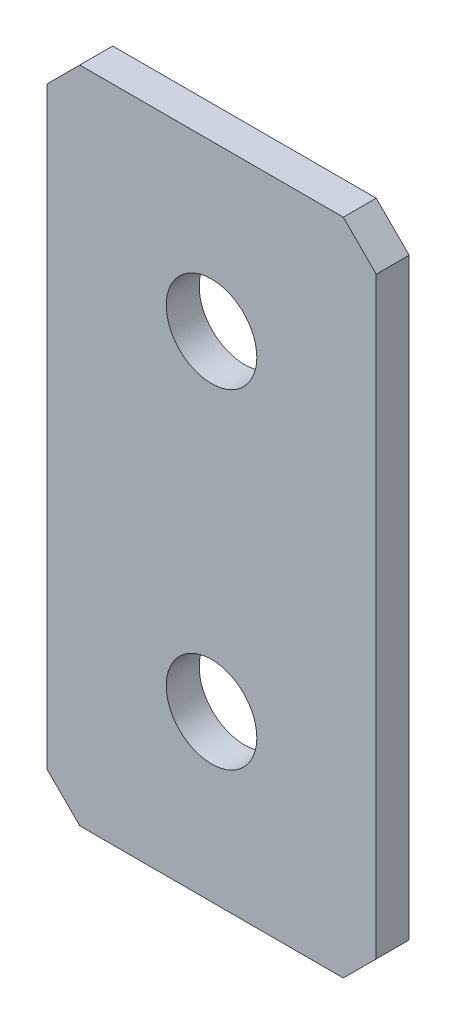
ISO-10303-21;
HEADER;
FILE_DESCRIPTION(('STEP AP214'),'2;1');
FILE_NAME('part.step','',(''),(''),'','','');
FILE_SCHEMA(('AUTOMOTIVE_DESIGN { 1 0 10303 214 1 1 1 1 }'));
ENDSEC;
DATA;
#1=APPLICATION_CONTEXT('core data for automotive mechanical design processes');
#2=APPLICATION_PROTOCOL_DEFINITION('international standard','automotive_design',2000,#1);
#3=PRODUCT_CONTEXT('',#1,'mechanical');
#4=PRODUCT('Part','Part','',(#3));
#5=PRODUCT_RELATED_PRODUCT_CATEGORY('part','',(#4));
#6=PRODUCT_DEFINITION_FORMATION('','',#4);
#7=PRODUCT_DEFINITION_CONTEXT('part definition',#1,'design');
#8=PRODUCT_DEFINITION('design','',#6,#7);
#9=PRODUCT_DEFINITION_SHAPE('','',#8);
#10=(LENGTH_UNIT() NAMED_UNIT(*) SI_UNIT(.MILLI.,.METRE.));
#11=(NAMED_UNIT(*) PLANE_ANGLE_UNIT() SI_UNIT($,.RADIAN.));
#12=(NAMED_UNIT(*) SI_UNIT($,.STERADIAN.) SOLID_ANGLE_UNIT());
#13=UNCERTAINTY_MEASURE_WITH_UNIT(LENGTH_MEASURE(1.E-05),#10,'distance_accuracy_value','');
#14=(GEOMETRIC_REPRESENTATION_CONTEXT(3) GLOBAL_UNCERTAINTY_ASSIGNED_CONTEXT((#13)) GLOBAL_UNIT_ASSIGNED_CONTEXT((#10,
#11,#12)) REPRESENTATION_CONTEXT('',''));
#15=CARTESIAN_POINT('',(0.,0.,0.));
#16=DIRECTION('',(0.,0.,1.));
#17=DIRECTION('',(1.,0.,0.));
#18=AXIS2_PLACEMENT_3D('',#15,#16,#17);
#19=CARTESIAN_POINT('',(9.99999999999999,-20.,2.));
#20=DIRECTION('',(-1.,0.,0.));
#21=DIRECTION('',(0.,0.,1.));
#22=AXIS2_PLACEMENT_3D('',#19,#20,#21);
#23=PLANE('',#22);
#24=DIRECTION('',(0.,1.,0.));
#25=VECTOR('',#24,1.);
#26=CARTESIAN_POINT('',(9.99999999999999,-20.,2.));
#27=LINE('',#26,#25);
#28=CARTESIAN_POINT('',(9.99999999999999,-18.,2.));
#29=VERTEX_POINT('',#28);
#30=CARTESIAN_POINT('',(9.99999999999999,18.,2.));
#31=VERTEX_POINT('',#30);
#32=EDGE_CURVE('E127',#29,#31,#27,.T.);
#33=ORIENTED_EDGE('',*,*,#32,.F.);
#34=DIRECTION('',(0.,0.,-1.));
#35=VECTOR('',#34,1.);
#36=CARTESIAN_POINT('',(9.99999999999999,-18.,2.));
#37=LINE('',#36,#35);
#38=CARTESIAN_POINT('',(9.99999999999999,-18.,0.));
#39=VERTEX_POINT('',#38);
#40=EDGE_CURVE('E153',#29,#39,#37,.T.);
#41=ORIENTED_EDGE('',*,*,#40,.T.);
#42=DIRECTION('',(0.,1.,0.));
#43=VECTOR('',#42,1.);
#44=CARTESIAN_POINT('',(9.99999999999999,-20.,0.));
#45=LINE('',#44,#43);
#46=CARTESIAN_POINT('',(9.99999999999999,18.,0.));
#47=VERTEX_POINT('',#46);
#48=EDGE_CURVE('E161',#39,#47,#45,.T.);
#49=ORIENTED_EDGE('',*,*,#48,.T.);
#50=DIRECTION('',(0.,0.,1.));
#51=VECTOR('',#50,1.);
#52=CARTESIAN_POINT('',(9.99999999999999,18.,2.));
#53=LINE('',#52,#51);
#54=EDGE_CURVE('E151',#47,#31,#53,.T.);
#55=ORIENTED_EDGE('',*,*,#54,.T.);
#56=EDGE_LOOP('',(#33,#41,#49,#55));
#57=FACE_BOUND('',#56,.T.);
#58=ADVANCED_FACE('F36',(#57),#23,.F.);
#59=CARTESIAN_POINT('',(-10.,20.,2.));
#60=DIRECTION('',(0.,-1.,0.));
#61=DIRECTION('',(0.,0.,-1.));
#62=AXIS2_PLACEMENT_3D('',#59,#60,#61);
#63=PLANE('',#62);
#64=DIRECTION('',(-1.,0.,0.));
#65=VECTOR('',#64,1.);
#66=CARTESIAN_POINT('',(-10.,20.,0.));
#67=LINE('',#66,#65);
#68=CARTESIAN_POINT('',(8.,20.,0.));
#69=VERTEX_POINT('',#68);
#70=CARTESIAN_POINT('',(-8.00000000000001,20.,0.));
#71=VERTEX_POINT('',#70);
#72=EDGE_CURVE('E132',#69,#71,#67,.T.);
#73=ORIENTED_EDGE('',*,*,#72,.T.);
#74=DIRECTION('',(0.,0.,1.));
#75=VECTOR('',#74,1.);
#76=CARTESIAN_POINT('',(-8.00000000000001,20.,2.));
#77=LINE('',#76,#75);
#78=CARTESIAN_POINT('',(-8.00000000000001,20.,2.));
#79=VERTEX_POINT('',#78);
#80=EDGE_CURVE('E11',#71,#79,#77,.T.);
#81=ORIENTED_EDGE('',*,*,#80,.T.);
#82=DIRECTION('',(-1.,0.,0.));
#83=VECTOR('',#82,1.);
#84=CARTESIAN_POINT('',(-10.,20.,2.));
#85=LINE('',#84,#83);
#86=CARTESIAN_POINT('',(8.,20.,2.));
#87=VERTEX_POINT('',#86);
#88=EDGE_CURVE('E130',#87,#79,#85,.T.);
#89=ORIENTED_EDGE('',*,*,#88,.F.);
#90=DIRECTION('',(0.,0.,-1.));
#91=VECTOR('',#90,1.);
#92=CARTESIAN_POINT('',(8.,20.,2.));
#93=LINE('',#92,#91);
#94=EDGE_CURVE('E44',#87,#69,#93,.T.);
#95=ORIENTED_EDGE('',*,*,#94,.T.);
#96=EDGE_LOOP('',(#73,#81,#89,#95));
#97=FACE_BOUND('',#96,.T.);
#98=ADVANCED_FACE('F158',(#97),#63,.F.);
#99=CARTESIAN_POINT('',(-10.,-20.,2.));
#100=DIRECTION('',(1.,0.,0.));
#101=DIRECTION('',(0.,0.,-1.));
#102=AXIS2_PLACEMENT_3D('',#99,#100,#101);
#103=PLANE('',#102);
#104=DIRECTION('',(0.,-1.,0.));
#105=VECTOR('',#104,1.);
#106=CARTESIAN_POINT('',(-10.,-20.,0.));
#107=LINE('',#106,#105);
#108=CARTESIAN_POINT('',(-10.,18.,0.));
#109=VERTEX_POINT('',#108);
#110=CARTESIAN_POINT('',(-10.,-18.,0.));
#111=VERTEX_POINT('',#110);
#112=EDGE_CURVE('E128',#109,#111,#107,.T.);
#113=ORIENTED_EDGE('',*,*,#112,.T.);
#114=DIRECTION('',(0.,0.,1.));
#115=VECTOR('',#114,1.);
#116=CARTESIAN_POINT('',(-10.,-18.,2.));
#117=LINE('',#116,#115);
#118=CARTESIAN_POINT('',(-10.,-18.,2.));
#119=VERTEX_POINT('',#118);
#120=EDGE_CURVE('E106',#111,#119,#117,.T.);
#121=ORIENTED_EDGE('',*,*,#120,.T.);
#122=DIRECTION('',(0.,-1.,0.));
#123=VECTOR('',#122,1.);
#124=CARTESIAN_POINT('',(-10.,-20.,2.));
#125=LINE('',#124,#123);
#126=CARTESIAN_POINT('',(-10.,18.,2.));
#127=VERTEX_POINT('',#126);
#128=EDGE_CURVE('E166',#127,#119,#125,.T.);
#129=ORIENTED_EDGE('',*,*,#128,.F.);
#130=DIRECTION('',(0.,0.,-1.));
#131=VECTOR('',#130,1.);
#132=CARTESIAN_POINT('',(-10.,18.,2.));
#133=LINE('',#132,#131);
#134=EDGE_CURVE('E111',#127,#109,#133,.T.);
#135=ORIENTED_EDGE('',*,*,#134,.T.);
#136=EDGE_LOOP('',(#113,#121,#129,#135));
#137=FACE_BOUND('',#136,.T.);
#138=ADVANCED_FACE('F193',(#137),#103,.F.);
#139=CARTESIAN_POINT('',(-10.,-20.,2.));
#140=DIRECTION('',(0.,1.,0.));
#141=DIRECTION('',(0.,0.,1.));
#142=AXIS2_PLACEMENT_3D('',#139,#140,#141);
#143=PLANE('',#142);
#144=DIRECTION('',(1.,0.,0.));
#145=VECTOR('',#144,1.);
#146=CARTESIAN_POINT('',(-10.,-20.,2.));
#147=LINE('',#146,#145);
#148=CARTESIAN_POINT('',(-8.00000000000001,-20.,2.));
#149=VERTEX_POINT('',#148);
#150=CARTESIAN_POINT('',(8.,-20.,2.));
#151=VERTEX_POINT('',#150);
#152=EDGE_CURVE('E121',#149,#151,#147,.T.);
#153=ORIENTED_EDGE('',*,*,#152,.F.);
#154=DIRECTION('',(0.,0.,-1.));
#155=VECTOR('',#154,1.);
#156=CARTESIAN_POINT('',(-8.00000000000001,-20.,2.));
#157=LINE('',#156,#155);
#158=CARTESIAN_POINT('',(-8.00000000000001,-20.,0.));
#159=VERTEX_POINT('',#158);
#160=EDGE_CURVE('E105',#149,#159,#157,.T.);
#161=ORIENTED_EDGE('',*,*,#160,.T.);
#162=DIRECTION('',(1.,0.,0.));
#163=VECTOR('',#162,1.);
#164=CARTESIAN_POINT('',(-10.,-20.,0.));
#165=LINE('',#164,#163);
#166=CARTESIAN_POINT('',(8.,-20.,0.));
#167=VERTEX_POINT('',#166);
#168=EDGE_CURVE('E118',#159,#167,#165,.T.);
#169=ORIENTED_EDGE('',*,*,#168,.T.);
#170=DIRECTION('',(0.,0.,1.));
#171=VECTOR('',#170,1.);
#172=CARTESIAN_POINT('',(8.,-20.,2.));
#173=LINE('',#172,#171);
#174=EDGE_CURVE('E123',#167,#151,#173,.T.);
#175=ORIENTED_EDGE('',*,*,#174,.T.);
#176=EDGE_LOOP('',(#153,#161,#169,#175));
#177=FACE_BOUND('',#176,.T.);
#178=ADVANCED_FACE('F117',(#177),#143,.F.);
#179=CARTESIAN_POINT('',(0.,0.,2.));
#180=DIRECTION('',(0.,0.,-1.));
#181=DIRECTION('',(-1.,0.,0.));
#182=AXIS2_PLACEMENT_3D('',#179,#180,#181);
#183=PLANE('',#182);
#184=CARTESIAN_POINT('',(0.,10.,2.));
#185=DIRECTION('',(0.,0.,1.));
#186=DIRECTION('',(1.,0.,0.));
#187=AXIS2_PLACEMENT_3D('',#184,#185,#186);
#188=CIRCLE('',#187,2.75);
#189=CARTESIAN_POINT('',(2.75,10.,2.));
#190=VERTEX_POINT('',#189);
#191=EDGE_CURVE('E178',#190,#190,#188,.T.);
#192=ORIENTED_EDGE('',*,*,#191,.F.);
#193=EDGE_LOOP('',(#192));
#194=FACE_BOUND('',#193,.T.);
#195=CARTESIAN_POINT('',(0.,-10.,2.));
#196=DIRECTION('',(0.,0.,1.));
#197=DIRECTION('',(1.,0.,0.));
#198=AXIS2_PLACEMENT_3D('',#195,#196,#197);
#199=CIRCLE('',#198,2.75);
#200=CARTESIAN_POINT('',(2.75000000000001,-10.,2.));
#201=VERTEX_POINT('',#200);
#202=EDGE_CURVE('E172',#201,#201,#199,.T.);
#203=ORIENTED_EDGE('',*,*,#202,.F.);
#204=EDGE_LOOP('',(#203));
#205=FACE_BOUND('',#204,.T.);
#206=ORIENTED_EDGE('',*,*,#128,.T.);
#207=DIRECTION('',(-0.707106781186546,0.707106781186549,0.));
#208=VECTOR('',#207,1.);
#209=CARTESIAN_POINT('',(-8.00000000000001,-20.,2.));
#210=LINE('',#209,#208);
#211=EDGE_CURVE('E149',#119,#149,#210,.F.);
#212=ORIENTED_EDGE('',*,*,#211,.T.);
#213=ORIENTED_EDGE('',*,*,#152,.T.);
#214=DIRECTION('',(-0.70710678118655,-0.707106781186545,0.));
#215=VECTOR('',#214,1.);
#216=CARTESIAN_POINT('',(9.99999999999999,-18.,2.));
#217=LINE('',#216,#215);
#218=EDGE_CURVE('E147',#151,#29,#217,.F.);
#219=ORIENTED_EDGE('',*,*,#218,.T.);
#220=ORIENTED_EDGE('',*,*,#32,.T.);
#221=DIRECTION('',(0.707106781186546,-0.707106781186549,0.));
#222=VECTOR('',#221,1.);
#223=CARTESIAN_POINT('',(8.,20.,2.));
#224=LINE('',#223,#222);
#225=EDGE_CURVE('E56',#31,#87,#224,.F.);
#226=ORIENTED_EDGE('',*,*,#225,.T.);
#227=ORIENTED_EDGE('',*,*,#88,.T.);
#228=DIRECTION('',(0.70710678118655,0.707106781186545,0.));
#229=VECTOR('',#228,1.);
#230=CARTESIAN_POINT('',(-10.,18.,2.));
#231=LINE('',#230,#229);
#232=EDGE_CURVE('E145',#79,#127,#231,.F.);
#233=ORIENTED_EDGE('',*,*,#232,.T.);
#234=EDGE_LOOP('',(#206,#212,#213,#219,#220,#226,#227,#233));
#235=FACE_BOUND('',#234,.T.);
#236=ADVANCED_FACE('F184',(#194,#205,#235),#183,.F.);
#237=CARTESIAN_POINT('',(0.,0.,0.));
#238=DIRECTION('',(0.,0.,-1.));
#239=DIRECTION('',(-1.,0.,0.));
#240=AXIS2_PLACEMENT_3D('',#237,#238,#239);
#241=PLANE('',#240);
#242=CARTESIAN_POINT('',(0.,10.,0.));
#243=DIRECTION('',(0.,0.,1.));
#244=DIRECTION('',(1.,0.,0.));
#245=AXIS2_PLACEMENT_3D('',#242,#243,#244);
#246=CIRCLE('',#245,2.75);
#247=CARTESIAN_POINT('',(2.75,10.,0.));
#248=VERTEX_POINT('',#247);
#249=EDGE_CURVE('E175',#248,#248,#246,.T.);
#250=ORIENTED_EDGE('',*,*,#249,.T.);
#251=EDGE_LOOP('',(#250));
#252=FACE_BOUND('',#251,.T.);
#253=CARTESIAN_POINT('',(0.,-10.,0.));
#254=DIRECTION('',(0.,0.,1.));
#255=DIRECTION('',(1.,0.,0.));
#256=AXIS2_PLACEMENT_3D('',#253,#254,#255);
#257=CIRCLE('',#256,2.75);
#258=CARTESIAN_POINT('',(2.75000000000001,-10.,0.));
#259=VERTEX_POINT('',#258);
#260=EDGE_CURVE('E162',#259,#259,#257,.T.);
#261=ORIENTED_EDGE('',*,*,#260,.T.);
#262=EDGE_LOOP('',(#261));
#263=FACE_BOUND('',#262,.T.);
#264=ORIENTED_EDGE('',*,*,#168,.F.);
#265=DIRECTION('',(0.707106781186546,-0.707106781186549,0.));
#266=VECTOR('',#265,1.);
#267=CARTESIAN_POINT('',(-14.,-14.,0.));
#268=LINE('',#267,#266);
#269=EDGE_CURVE('E101',#159,#111,#268,.F.);
#270=ORIENTED_EDGE('',*,*,#269,.T.);
#271=ORIENTED_EDGE('',*,*,#112,.F.);
#272=DIRECTION('',(-0.70710678118655,-0.707106781186545,0.));
#273=VECTOR('',#272,1.);
#274=CARTESIAN_POINT('',(-14.,14.0000000000001,0.));
#275=LINE('',#274,#273);
#276=EDGE_CURVE('E138',#109,#71,#275,.F.);
#277=ORIENTED_EDGE('',*,*,#276,.T.);
#278=ORIENTED_EDGE('',*,*,#72,.F.);
#279=DIRECTION('',(-0.707106781186546,0.707106781186549,0.));
#280=VECTOR('',#279,1.);
#281=CARTESIAN_POINT('',(14.,14.,0.));
#282=LINE('',#281,#280);
#283=EDGE_CURVE('E122',#69,#47,#282,.F.);
#284=ORIENTED_EDGE('',*,*,#283,.T.);
#285=ORIENTED_EDGE('',*,*,#48,.F.);
#286=DIRECTION('',(0.70710678118655,0.707106781186545,0.));
#287=VECTOR('',#286,1.);
#288=CARTESIAN_POINT('',(14.,-14.0000000000001,0.));
#289=LINE('',#288,#287);
#290=EDGE_CURVE('E112',#39,#167,#289,.F.);
#291=ORIENTED_EDGE('',*,*,#290,.T.);
#292=EDGE_LOOP('',(#264,#270,#271,#277,#278,#284,#285,#291));
#293=FACE_BOUND('',#292,.T.);
#294=ADVANCED_FACE('F125',(#252,#263,#293),#241,.T.);
#295=CARTESIAN_POINT('',(-8.00000000000001,-20.,2.));
#296=DIRECTION('',(0.707106781186549,0.707106781186546,0.));
#297=DIRECTION('',(0.,0.,-1.));
#298=AXIS2_PLACEMENT_3D('',#295,#296,#297);
#299=PLANE('',#298);
#300=ORIENTED_EDGE('',*,*,#211,.F.);
#301=ORIENTED_EDGE('',*,*,#120,.F.);
#302=ORIENTED_EDGE('',*,*,#269,.F.);
#303=ORIENTED_EDGE('',*,*,#160,.F.);
#304=EDGE_LOOP('',(#300,#301,#302,#303));
#305=FACE_BOUND('',#304,.T.);
#306=ADVANCED_FACE('F104',(#305),#299,.F.);
#307=CARTESIAN_POINT('',(9.99999999999999,-18.,2.));
#308=DIRECTION('',(-0.707106781186545,0.70710678118655,0.));
#309=DIRECTION('',(0.,0.,-1.));
#310=AXIS2_PLACEMENT_3D('',#307,#308,#309);
#311=PLANE('',#310);
#312=ORIENTED_EDGE('',*,*,#218,.F.);
#313=ORIENTED_EDGE('',*,*,#174,.F.);
#314=ORIENTED_EDGE('',*,*,#290,.F.);
#315=ORIENTED_EDGE('',*,*,#40,.F.);
#316=EDGE_LOOP('',(#312,#313,#314,#315));
#317=FACE_BOUND('',#316,.T.);
#318=ADVANCED_FACE('F197',(#317),#311,.F.);
#319=CARTESIAN_POINT('',(-10.,18.,2.));
#320=DIRECTION('',(0.707106781186545,-0.70710678118655,0.));
#321=DIRECTION('',(0.,0.,-1.));
#322=AXIS2_PLACEMENT_3D('',#319,#320,#321);
#323=PLANE('',#322);
#324=ORIENTED_EDGE('',*,*,#232,.F.);
#325=ORIENTED_EDGE('',*,*,#80,.F.);
#326=ORIENTED_EDGE('',*,*,#276,.F.);
#327=ORIENTED_EDGE('',*,*,#134,.F.);
#328=EDGE_LOOP('',(#324,#325,#326,#327));
#329=FACE_BOUND('',#328,.T.);
#330=ADVANCED_FACE('F195',(#329),#323,.F.);
#331=CARTESIAN_POINT('',(8.,20.,2.));
#332=DIRECTION('',(-0.707106781186549,-0.707106781186546,0.));
#333=DIRECTION('',(0.,0.,-1.));
#334=AXIS2_PLACEMENT_3D('',#331,#332,#333);
#335=PLANE('',#334);
#336=ORIENTED_EDGE('',*,*,#225,.F.);
#337=ORIENTED_EDGE('',*,*,#54,.F.);
#338=ORIENTED_EDGE('',*,*,#283,.F.);
#339=ORIENTED_EDGE('',*,*,#94,.F.);
#340=EDGE_LOOP('',(#336,#337,#338,#339));
#341=FACE_BOUND('',#340,.T.);
#342=ADVANCED_FACE('F38',(#341),#335,.F.);
#343=CARTESIAN_POINT('',(0.,-10.,2.));
#344=DIRECTION('',(0.,0.,1.));
#345=DIRECTION('',(1.,0.,0.));
#346=AXIS2_PLACEMENT_3D('',#343,#344,#345);
#347=CYLINDRICAL_SURFACE('',#346,2.75);
#348=ORIENTED_EDGE('',*,*,#260,.F.);
#349=EDGE_LOOP('',(#348));
#350=FACE_BOUND('',#349,.T.);
#351=ORIENTED_EDGE('',*,*,#202,.T.);
#352=EDGE_LOOP('',(#351));
#353=FACE_BOUND('',#352,.T.);
#354=ADVANCED_FACE('F202',(#350,#353),#347,.F.);
#355=CARTESIAN_POINT('',(0.,10.,2.));
#356=DIRECTION('',(0.,0.,1.));
#357=DIRECTION('',(1.,0.,0.));
#358=AXIS2_PLACEMENT_3D('',#355,#356,#357);
#359=CYLINDRICAL_SURFACE('',#358,2.75);
#360=ORIENTED_EDGE('',*,*,#249,.F.);
#361=EDGE_LOOP('',(#360));
#362=FACE_BOUND('',#361,.T.);
#363=ORIENTED_EDGE('',*,*,#191,.T.);
#364=EDGE_LOOP('',(#363));
#365=FACE_BOUND('',#364,.T.);
#366=ADVANCED_FACE('F182',(#362,#365),#359,.F.);
#367=CLOSED_SHELL('',(#58,#98,#138,#178,#236,#294,#306,#318,#330,#342,#354,#366));
#368=MANIFOLD_SOLID_BREP('B2',#367);
#369=ADVANCED_BREP_SHAPE_REPRESENTATION('',(#18,#368),#14);
#370=SHAPE_DEFINITION_REPRESENTATION(#9,#369);
ENDSEC;
END-ISO-10303-21;
